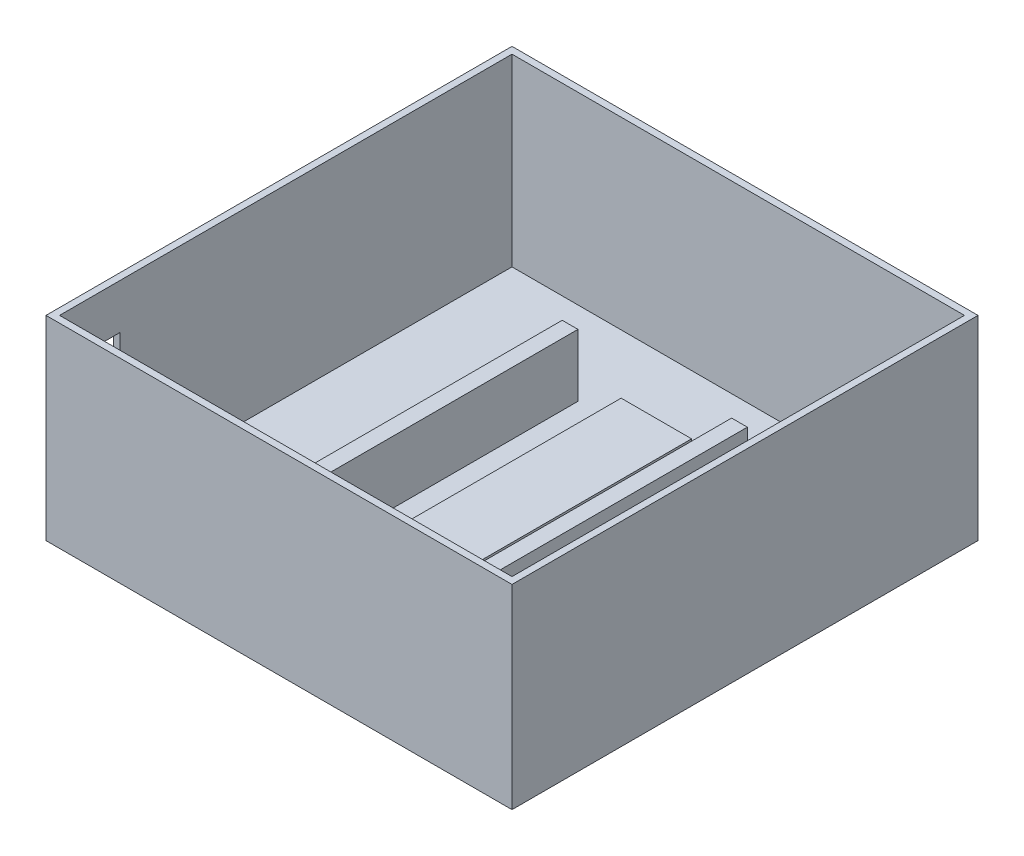
ISO-10303-21;
HEADER;
FILE_DESCRIPTION(('STEP AP214'),'2;1');
FILE_NAME('part.step','',(''),(''),'','','');
FILE_SCHEMA(('AUTOMOTIVE_DESIGN { 1 0 10303 214 1 1 1 1 }'));
ENDSEC;
DATA;
#1=APPLICATION_CONTEXT('core data for automotive mechanical design processes');
#2=APPLICATION_PROTOCOL_DEFINITION('international standard','automotive_design',2000,#1);
#3=PRODUCT_CONTEXT('',#1,'mechanical');
#4=PRODUCT('Part','Part','',(#3));
#5=PRODUCT_RELATED_PRODUCT_CATEGORY('part','',(#4));
#6=PRODUCT_DEFINITION_FORMATION('','',#4);
#7=PRODUCT_DEFINITION_CONTEXT('part definition',#1,'design');
#8=PRODUCT_DEFINITION('design','',#6,#7);
#9=PRODUCT_DEFINITION_SHAPE('','',#8);
#10=(LENGTH_UNIT() NAMED_UNIT(*) SI_UNIT(.MILLI.,.METRE.));
#11=(NAMED_UNIT(*) PLANE_ANGLE_UNIT() SI_UNIT($,.RADIAN.));
#12=(NAMED_UNIT(*) SI_UNIT($,.STERADIAN.) SOLID_ANGLE_UNIT());
#13=UNCERTAINTY_MEASURE_WITH_UNIT(LENGTH_MEASURE(1.E-05),#10,'distance_accuracy_value','');
#14=(GEOMETRIC_REPRESENTATION_CONTEXT(3) GLOBAL_UNCERTAINTY_ASSIGNED_CONTEXT((#13)) GLOBAL_UNIT_ASSIGNED_CONTEXT((#10,
#11,#12)) REPRESENTATION_CONTEXT('',''));
#15=CARTESIAN_POINT('',(0.,0.,0.));
#16=DIRECTION('',(0.,0.,1.));
#17=DIRECTION('',(1.,0.,0.));
#18=AXIS2_PLACEMENT_3D('',#15,#16,#17);
#19=CARTESIAN_POINT('',(14.1780902362177,13.5,0.));
#20=DIRECTION('',(1.,0.,0.));
#21=DIRECTION('',(0.,0.,-1.));
#22=AXIS2_PLACEMENT_3D('',#19,#20,#21);
#23=PLANE('',#22);
#24=DIRECTION('',(0.,0.,1.));
#25=VECTOR('',#24,1.);
#26=CARTESIAN_POINT('',(14.1780902362177,1.99999999999999,0.));
#27=LINE('',#26,#25);
#28=CARTESIAN_POINT('',(14.1780902362175,1.99999999999999,-26.3514914841522));
#29=VERTEX_POINT('',#28);
#30=CARTESIAN_POINT('',(14.1780902362179,1.99999999999999,26.3514914841522));
#31=VERTEX_POINT('',#30);
#32=EDGE_CURVE('E106',#29,#31,#27,.T.);
#33=ORIENTED_EDGE('',*,*,#32,.T.);
#34=DIRECTION('',(0.,-1.,0.));
#35=VECTOR('',#34,1.);
#36=CARTESIAN_POINT('',(14.1780902362179,13.5,26.3514914841522));
#37=LINE('',#36,#35);
#38=CARTESIAN_POINT('',(14.1780902362179,13.5,26.3514914841522));
#39=VERTEX_POINT('',#38);
#40=EDGE_CURVE('E12',#39,#31,#37,.T.);
#41=ORIENTED_EDGE('',*,*,#40,.F.);
#42=DIRECTION('',(0.,0.,1.));
#43=VECTOR('',#42,1.);
#44=CARTESIAN_POINT('',(14.1780902362177,13.5,0.));
#45=LINE('',#44,#43);
#46=CARTESIAN_POINT('',(14.1780902362175,13.5,-26.3514914841522));
#47=VERTEX_POINT('',#46);
#48=EDGE_CURVE('E94',#47,#39,#45,.T.);
#49=ORIENTED_EDGE('',*,*,#48,.F.);
#50=DIRECTION('',(0.,-1.,0.));
#51=VECTOR('',#50,1.);
#52=CARTESIAN_POINT('',(14.1780902362175,13.5,-26.3514914841522));
#53=LINE('',#52,#51);
#54=EDGE_CURVE('E102',#47,#29,#53,.T.);
#55=ORIENTED_EDGE('',*,*,#54,.T.);
#56=EDGE_LOOP('',(#33,#41,#49,#55));
#57=FACE_BOUND('',#56,.T.);
#58=ADVANCED_FACE('F43',(#57),#23,.F.);
#59=CARTESIAN_POINT('',(2.01394456665728E-12,13.5,26.3514914841533));
#60=DIRECTION('',(0.,0.,-1.));
#61=DIRECTION('',(-1.,0.,0.));
#62=AXIS2_PLACEMENT_3D('',#59,#60,#61);
#63=PLANE('',#62);
#64=DIRECTION('',(1.,0.,0.));
#65=VECTOR('',#64,1.);
#66=CARTESIAN_POINT('',(2.01394456665728E-12,1.99999999999999,26.3514914841533));
#67=LINE('',#66,#65);
#68=CARTESIAN_POINT('',(17.0834365961209,1.99999999999999,26.351491484152));
#69=VERTEX_POINT('',#68);
#70=EDGE_CURVE('E98',#31,#69,#67,.T.);
#71=ORIENTED_EDGE('',*,*,#70,.T.);
#72=DIRECTION('',(0.,-1.,0.));
#73=VECTOR('',#72,1.);
#74=CARTESIAN_POINT('',(17.0834365961209,13.5,26.351491484152));
#75=LINE('',#74,#73);
#76=CARTESIAN_POINT('',(17.0834365961209,13.5,26.351491484152));
#77=VERTEX_POINT('',#76);
#78=EDGE_CURVE('E51',#77,#69,#75,.T.);
#79=ORIENTED_EDGE('',*,*,#78,.F.);
#80=DIRECTION('',(1.,0.,0.));
#81=VECTOR('',#80,1.);
#82=CARTESIAN_POINT('',(2.01394456665728E-12,13.5,26.3514914841533));
#83=LINE('',#82,#81);
#84=EDGE_CURVE('E89',#39,#77,#83,.T.);
#85=ORIENTED_EDGE('',*,*,#84,.F.);
#86=ORIENTED_EDGE('',*,*,#40,.T.);
#87=EDGE_LOOP('',(#71,#79,#85,#86));
#88=FACE_BOUND('',#87,.T.);
#89=ADVANCED_FACE('F97',(#88),#63,.F.);
#90=CARTESIAN_POINT('',(17.0834365961207,13.5,-1.19208208170543E-13));
#91=DIRECTION('',(-1.,0.,0.));
#92=DIRECTION('',(0.,0.,1.));
#93=AXIS2_PLACEMENT_3D('',#90,#91,#92);
#94=PLANE('',#93);
#95=DIRECTION('',(0.,0.,-1.));
#96=VECTOR('',#95,1.);
#97=CARTESIAN_POINT('',(17.0834365961207,1.99999999999999,-1.19208208170543E-13));
#98=LINE('',#97,#96);
#99=CARTESIAN_POINT('',(17.0834365961205,1.99999999999999,-26.3514914841522));
#100=VERTEX_POINT('',#99);
#101=EDGE_CURVE('E76',#69,#100,#98,.T.);
#102=ORIENTED_EDGE('',*,*,#101,.T.);
#103=DIRECTION('',(0.,-1.,0.));
#104=VECTOR('',#103,1.);
#105=CARTESIAN_POINT('',(17.0834365961205,13.5,-26.3514914841522));
#106=LINE('',#105,#104);
#107=CARTESIAN_POINT('',(17.0834365961205,13.5,-26.3514914841522));
#108=VERTEX_POINT('',#107);
#109=EDGE_CURVE('E99',#108,#100,#106,.T.);
#110=ORIENTED_EDGE('',*,*,#109,.F.);
#111=DIRECTION('',(0.,0.,-1.));
#112=VECTOR('',#111,1.);
#113=CARTESIAN_POINT('',(17.0834365961207,13.5,-1.19208208170543E-13));
#114=LINE('',#113,#112);
#115=EDGE_CURVE('E92',#77,#108,#114,.T.);
#116=ORIENTED_EDGE('',*,*,#115,.F.);
#117=ORIENTED_EDGE('',*,*,#78,.T.);
#118=EDGE_LOOP('',(#102,#110,#116,#117));
#119=FACE_BOUND('',#118,.T.);
#120=ADVANCED_FACE('F100',(#119),#94,.F.);
#121=CARTESIAN_POINT('',(0.,13.5,-26.3514914841522));
#122=DIRECTION('',(0.,0.,1.));
#123=DIRECTION('',(1.,0.,0.));
#124=AXIS2_PLACEMENT_3D('',#121,#122,#123);
#125=PLANE('',#124);
#126=DIRECTION('',(-1.,0.,0.));
#127=VECTOR('',#126,1.);
#128=CARTESIAN_POINT('',(0.,1.99999999999999,-26.3514914841522));
#129=LINE('',#128,#127);
#130=EDGE_CURVE('E82',#100,#29,#129,.T.);
#131=ORIENTED_EDGE('',*,*,#130,.T.);
#132=ORIENTED_EDGE('',*,*,#54,.F.);
#133=DIRECTION('',(-1.,0.,0.));
#134=VECTOR('',#133,1.);
#135=CARTESIAN_POINT('',(0.,13.5,-26.3514914841522));
#136=LINE('',#135,#134);
#137=EDGE_CURVE('E59',#108,#47,#136,.T.);
#138=ORIENTED_EDGE('',*,*,#137,.F.);
#139=ORIENTED_EDGE('',*,*,#109,.T.);
#140=EDGE_LOOP('',(#131,#132,#138,#139));
#141=FACE_BOUND('',#140,.T.);
#142=ADVANCED_FACE('F113',(#141),#125,.F.);
#143=CARTESIAN_POINT('',(0.,13.5,0.));
#144=DIRECTION('',(0.,1.,0.));
#145=DIRECTION('',(0.,0.,1.));
#146=AXIS2_PLACEMENT_3D('',#143,#144,#145);
#147=PLANE('',#146);
#148=ORIENTED_EDGE('',*,*,#48,.T.);
#149=ORIENTED_EDGE('',*,*,#84,.T.);
#150=ORIENTED_EDGE('',*,*,#115,.T.);
#151=ORIENTED_EDGE('',*,*,#137,.T.);
#152=EDGE_LOOP('',(#148,#149,#150,#151));
#153=FACE_BOUND('',#152,.T.);
#154=ADVANCED_FACE('F90',(#153),#147,.T.);
#155=CARTESIAN_POINT('',(0.,1.99999999999999,0.));
#156=DIRECTION('',(0.,1.,0.));
#157=DIRECTION('',(0.,0.,1.));
#158=AXIS2_PLACEMENT_3D('',#155,#156,#157);
#159=PLANE('',#158);
#160=ORIENTED_EDGE('',*,*,#32,.F.);
#161=ORIENTED_EDGE('',*,*,#130,.F.);
#162=ORIENTED_EDGE('',*,*,#101,.F.);
#163=ORIENTED_EDGE('',*,*,#70,.F.);
#164=EDGE_LOOP('',(#160,#161,#162,#163));
#165=FACE_BOUND('',#164,.T.);
#166=ADVANCED_FACE('F116',(#165),#159,.F.);
#167=CLOSED_SHELL('',(#58,#89,#120,#142,#154,#166));
#168=MANIFOLD_SOLID_BREP('B2',#167);
#169=CARTESIAN_POINT('',(-17.0834365961207,13.5,0.));
#170=DIRECTION('',(1.,0.,0.));
#171=DIRECTION('',(0.,0.,-1.));
#172=AXIS2_PLACEMENT_3D('',#169,#170,#171);
#173=PLANE('',#172);
#174=DIRECTION('',(0.,0.,1.));
#175=VECTOR('',#174,1.);
#176=CARTESIAN_POINT('',(-17.0834365961207,1.99999999999999,0.));
#177=LINE('',#176,#175);
#178=CARTESIAN_POINT('',(-17.0834365961207,1.99999999999999,-26.3514914841522));
#179=VERTEX_POINT('',#178);
#180=CARTESIAN_POINT('',(-17.0834365961207,1.99999999999999,26.3514914841522));
#181=VERTEX_POINT('',#180);
#182=EDGE_CURVE('E238',#179,#181,#177,.T.);
#183=ORIENTED_EDGE('',*,*,#182,.T.);
#184=DIRECTION('',(0.,-1.,0.));
#185=VECTOR('',#184,1.);
#186=CARTESIAN_POINT('',(-17.0834365961207,13.5,26.3514914841522));
#187=LINE('',#186,#185);
#188=CARTESIAN_POINT('',(-17.0834365961207,13.5,26.3514914841522));
#189=VERTEX_POINT('',#188);
#190=EDGE_CURVE('E41',#189,#181,#187,.T.);
#191=ORIENTED_EDGE('',*,*,#190,.F.);
#192=DIRECTION('',(0.,0.,1.));
#193=VECTOR('',#192,1.);
#194=CARTESIAN_POINT('',(-17.0834365961207,13.5,0.));
#195=LINE('',#194,#193);
#196=CARTESIAN_POINT('',(-17.0834365961207,13.5,-26.3514914841522));
#197=VERTEX_POINT('',#196);
#198=EDGE_CURVE('E226',#197,#189,#195,.T.);
#199=ORIENTED_EDGE('',*,*,#198,.F.);
#200=DIRECTION('',(0.,-1.,0.));
#201=VECTOR('',#200,1.);
#202=CARTESIAN_POINT('',(-17.0834365961207,13.5,-26.3514914841522));
#203=LINE('',#202,#201);
#204=EDGE_CURVE('E234',#197,#179,#203,.T.);
#205=ORIENTED_EDGE('',*,*,#204,.T.);
#206=EDGE_LOOP('',(#183,#191,#199,#205));
#207=FACE_BOUND('',#206,.T.);
#208=ADVANCED_FACE('F175',(#207),#173,.F.);
#209=CARTESIAN_POINT('',(0.,13.5,26.3514914841522));
#210=DIRECTION('',(0.,0.,-1.));
#211=DIRECTION('',(-1.,0.,0.));
#212=AXIS2_PLACEMENT_3D('',#209,#210,#211);
#213=PLANE('',#212);
#214=DIRECTION('',(1.,0.,0.));
#215=VECTOR('',#214,1.);
#216=CARTESIAN_POINT('',(0.,1.99999999999999,26.3514914841522));
#217=LINE('',#216,#215);
#218=CARTESIAN_POINT('',(-14.1780902362177,1.99999999999999,26.3514914841522));
#219=VERTEX_POINT('',#218);
#220=EDGE_CURVE('E230',#181,#219,#217,.T.);
#221=ORIENTED_EDGE('',*,*,#220,.T.);
#222=DIRECTION('',(0.,-1.,0.));
#223=VECTOR('',#222,1.);
#224=CARTESIAN_POINT('',(-14.1780902362177,13.5,26.3514914841522));
#225=LINE('',#224,#223);
#226=CARTESIAN_POINT('',(-14.1780902362177,13.5,26.3514914841522));
#227=VERTEX_POINT('',#226);
#228=EDGE_CURVE('E183',#227,#219,#225,.T.);
#229=ORIENTED_EDGE('',*,*,#228,.F.);
#230=DIRECTION('',(1.,0.,0.));
#231=VECTOR('',#230,1.);
#232=CARTESIAN_POINT('',(0.,13.5,26.3514914841522));
#233=LINE('',#232,#231);
#234=EDGE_CURVE('E221',#189,#227,#233,.T.);
#235=ORIENTED_EDGE('',*,*,#234,.F.);
#236=ORIENTED_EDGE('',*,*,#190,.T.);
#237=EDGE_LOOP('',(#221,#229,#235,#236));
#238=FACE_BOUND('',#237,.T.);
#239=ADVANCED_FACE('F229',(#238),#213,.F.);
#240=CARTESIAN_POINT('',(-14.1780902362177,13.5,0.));
#241=DIRECTION('',(-1.,0.,0.));
#242=DIRECTION('',(0.,0.,1.));
#243=AXIS2_PLACEMENT_3D('',#240,#241,#242);
#244=PLANE('',#243);
#245=DIRECTION('',(0.,0.,-1.));
#246=VECTOR('',#245,1.);
#247=CARTESIAN_POINT('',(-14.1780902362177,1.99999999999999,0.));
#248=LINE('',#247,#246);
#249=CARTESIAN_POINT('',(-14.1780902362177,1.99999999999999,-26.3514914841522));
#250=VERTEX_POINT('',#249);
#251=EDGE_CURVE('E208',#219,#250,#248,.T.);
#252=ORIENTED_EDGE('',*,*,#251,.T.);
#253=DIRECTION('',(0.,-1.,0.));
#254=VECTOR('',#253,1.);
#255=CARTESIAN_POINT('',(-14.1780902362177,13.5,-26.3514914841522));
#256=LINE('',#255,#254);
#257=CARTESIAN_POINT('',(-14.1780902362177,13.5,-26.3514914841522));
#258=VERTEX_POINT('',#257);
#259=EDGE_CURVE('E231',#258,#250,#256,.T.);
#260=ORIENTED_EDGE('',*,*,#259,.F.);
#261=DIRECTION('',(0.,0.,-1.));
#262=VECTOR('',#261,1.);
#263=CARTESIAN_POINT('',(-14.1780902362177,13.5,0.));
#264=LINE('',#263,#262);
#265=EDGE_CURVE('E224',#227,#258,#264,.T.);
#266=ORIENTED_EDGE('',*,*,#265,.F.);
#267=ORIENTED_EDGE('',*,*,#228,.T.);
#268=EDGE_LOOP('',(#252,#260,#266,#267));
#269=FACE_BOUND('',#268,.T.);
#270=ADVANCED_FACE('F232',(#269),#244,.F.);
#271=CARTESIAN_POINT('',(0.,13.5,-26.3514914841522));
#272=DIRECTION('',(0.,0.,1.));
#273=DIRECTION('',(1.,0.,0.));
#274=AXIS2_PLACEMENT_3D('',#271,#272,#273);
#275=PLANE('',#274);
#276=DIRECTION('',(-1.,0.,0.));
#277=VECTOR('',#276,1.);
#278=CARTESIAN_POINT('',(0.,1.99999999999999,-26.3514914841522));
#279=LINE('',#278,#277);
#280=EDGE_CURVE('E214',#250,#179,#279,.T.);
#281=ORIENTED_EDGE('',*,*,#280,.T.);
#282=ORIENTED_EDGE('',*,*,#204,.F.);
#283=DIRECTION('',(-1.,0.,0.));
#284=VECTOR('',#283,1.);
#285=CARTESIAN_POINT('',(0.,13.5,-26.3514914841522));
#286=LINE('',#285,#284);
#287=EDGE_CURVE('E191',#258,#197,#286,.T.);
#288=ORIENTED_EDGE('',*,*,#287,.F.);
#289=ORIENTED_EDGE('',*,*,#259,.T.);
#290=EDGE_LOOP('',(#281,#282,#288,#289));
#291=FACE_BOUND('',#290,.T.);
#292=ADVANCED_FACE('F245',(#291),#275,.F.);
#293=CARTESIAN_POINT('',(0.,13.5,0.));
#294=DIRECTION('',(0.,1.,0.));
#295=DIRECTION('',(0.,0.,1.));
#296=AXIS2_PLACEMENT_3D('',#293,#294,#295);
#297=PLANE('',#296);
#298=ORIENTED_EDGE('',*,*,#198,.T.);
#299=ORIENTED_EDGE('',*,*,#234,.T.);
#300=ORIENTED_EDGE('',*,*,#265,.T.);
#301=ORIENTED_EDGE('',*,*,#287,.T.);
#302=EDGE_LOOP('',(#298,#299,#300,#301));
#303=FACE_BOUND('',#302,.T.);
#304=ADVANCED_FACE('F222',(#303),#297,.T.);
#305=CARTESIAN_POINT('',(0.,1.99999999999999,0.));
#306=DIRECTION('',(0.,1.,0.));
#307=DIRECTION('',(0.,0.,1.));
#308=AXIS2_PLACEMENT_3D('',#305,#306,#307);
#309=PLANE('',#308);
#310=ORIENTED_EDGE('',*,*,#182,.F.);
#311=ORIENTED_EDGE('',*,*,#280,.F.);
#312=ORIENTED_EDGE('',*,*,#251,.F.);
#313=ORIENTED_EDGE('',*,*,#220,.F.);
#314=EDGE_LOOP('',(#310,#311,#312,#313));
#315=FACE_BOUND('',#314,.T.);
#316=ADVANCED_FACE('F248',(#315),#309,.F.);
#317=CLOSED_SHELL('',(#208,#239,#270,#292,#304,#316));
#318=MANIFOLD_SOLID_BREP('B6',#317);
#319=CARTESIAN_POINT('',(0.,1.99999999999999,0.));
#320=DIRECTION('',(0.,1.,0.));
#321=DIRECTION('',(0.,0.,1.));
#322=AXIS2_PLACEMENT_3D('',#319,#320,#321);
#323=PLANE('',#322);
#324=DIRECTION('',(0.,0.,-1.));
#325=VECTOR('',#324,1.);
#326=CARTESIAN_POINT('',(41.75,1.99999999999999,-41.75));
#327=LINE('',#326,#325);
#328=CARTESIAN_POINT('',(41.75,1.99999999999999,41.75));
#329=VERTEX_POINT('',#328);
#330=CARTESIAN_POINT('',(41.75,1.99999999999999,-41.75));
#331=VERTEX_POINT('',#330);
#332=EDGE_CURVE('E469',#329,#331,#327,.T.);
#333=ORIENTED_EDGE('',*,*,#332,.T.);
#334=DIRECTION('',(-1.,0.,0.));
#335=VECTOR('',#334,1.);
#336=CARTESIAN_POINT('',(-41.75,1.99999999999999,-41.75));
#337=LINE('',#336,#335);
#338=CARTESIAN_POINT('',(-41.75,1.99999999999999,-41.75));
#339=VERTEX_POINT('',#338);
#340=EDGE_CURVE('E472',#331,#339,#337,.T.);
#341=ORIENTED_EDGE('',*,*,#340,.T.);
#342=DIRECTION('',(0.,0.,1.));
#343=VECTOR('',#342,1.);
#344=CARTESIAN_POINT('',(-41.75,1.99999999999999,-41.75));
#345=LINE('',#344,#343);
#346=CARTESIAN_POINT('',(-41.75,1.99999999999999,41.75));
#347=VERTEX_POINT('',#346);
#348=EDGE_CURVE('E476',#339,#347,#345,.T.);
#349=ORIENTED_EDGE('',*,*,#348,.T.);
#350=DIRECTION('',(1.,0.,0.));
#351=VECTOR('',#350,1.);
#352=CARTESIAN_POINT('',(-41.75,1.99999999999999,41.75));
#353=LINE('',#352,#351);
#354=EDGE_CURVE('E479',#347,#329,#353,.T.);
#355=ORIENTED_EDGE('',*,*,#354,.T.);
#356=EDGE_LOOP('',(#333,#341,#349,#355));
#357=FACE_BOUND('',#356,.T.);
#358=DIRECTION('',(-1.,0.,0.));
#359=VECTOR('',#358,1.);
#360=CARTESIAN_POINT('',(-6.5,1.99999999999999,-26.6420261201407));
#361=LINE('',#360,#359);
#362=CARTESIAN_POINT('',(6.5,1.99999999999999,-26.6420261201407));
#363=VERTEX_POINT('',#362);
#364=CARTESIAN_POINT('',(-6.5,1.99999999999999,-26.6420261201407));
#365=VERTEX_POINT('',#364);
#366=EDGE_CURVE('E453',#363,#365,#361,.T.);
#367=ORIENTED_EDGE('',*,*,#366,.F.);
#368=DIRECTION('',(0.,0.,-1.));
#369=VECTOR('',#368,1.);
#370=CARTESIAN_POINT('',(6.5,1.99999999999999,-26.6420261201407));
#371=LINE('',#370,#369);
#372=CARTESIAN_POINT('',(6.5,1.99999999999999,26.6420261201407));
#373=VERTEX_POINT('',#372);
#374=EDGE_CURVE('E437',#373,#363,#371,.T.);
#375=ORIENTED_EDGE('',*,*,#374,.F.);
#376=DIRECTION('',(1.,0.,0.));
#377=VECTOR('',#376,1.);
#378=CARTESIAN_POINT('',(-6.5,1.99999999999999,26.6420261201407));
#379=LINE('',#378,#377);
#380=CARTESIAN_POINT('',(-6.5,1.99999999999999,26.6420261201407));
#381=VERTEX_POINT('',#380);
#382=EDGE_CURVE('E444',#381,#373,#379,.T.);
#383=ORIENTED_EDGE('',*,*,#382,.F.);
#384=DIRECTION('',(0.,0.,1.));
#385=VECTOR('',#384,1.);
#386=CARTESIAN_POINT('',(-6.5,1.99999999999999,-26.6420261201407));
#387=LINE('',#386,#385);
#388=EDGE_CURVE('E455',#365,#381,#387,.T.);
#389=ORIENTED_EDGE('',*,*,#388,.F.);
#390=EDGE_LOOP('',(#367,#375,#383,#389));
#391=FACE_BOUND('',#390,.T.);
#392=ADVANCED_FACE('F298',(#357,#391),#323,.T.);
#393=CARTESIAN_POINT('',(43.,36.,-43.));
#394=DIRECTION('',(-1.,0.,0.));
#395=DIRECTION('',(0.,0.,1.));
#396=AXIS2_PLACEMENT_3D('',#393,#394,#395);
#397=PLANE('',#396);
#398=DIRECTION('',(0.,0.,-1.));
#399=VECTOR('',#398,1.);
#400=CARTESIAN_POINT('',(43.,0.,-43.));
#401=LINE('',#400,#399);
#402=CARTESIAN_POINT('',(43.,0.,43.));
#403=VERTEX_POINT('',#402);
#404=CARTESIAN_POINT('',(43.,0.,-43.));
#405=VERTEX_POINT('',#404);
#406=EDGE_CURVE('E494',#403,#405,#401,.T.);
#407=ORIENTED_EDGE('',*,*,#406,.T.);
#408=DIRECTION('',(0.,-1.,0.));
#409=VECTOR('',#408,1.);
#410=CARTESIAN_POINT('',(43.,36.,-43.));
#411=LINE('',#410,#409);
#412=CARTESIAN_POINT('',(43.,36.,-43.));
#413=VERTEX_POINT('',#412);
#414=EDGE_CURVE('E527',#413,#405,#411,.T.);
#415=ORIENTED_EDGE('',*,*,#414,.F.);
#416=DIRECTION('',(0.,0.,-1.));
#417=VECTOR('',#416,1.);
#418=CARTESIAN_POINT('',(43.,36.,-43.));
#419=LINE('',#418,#417);
#420=CARTESIAN_POINT('',(43.,36.,43.));
#421=VERTEX_POINT('',#420);
#422=EDGE_CURVE('E501',#421,#413,#419,.T.);
#423=ORIENTED_EDGE('',*,*,#422,.F.);
#424=DIRECTION('',(0.,-1.,0.));
#425=VECTOR('',#424,1.);
#426=CARTESIAN_POINT('',(43.,36.,43.));
#427=LINE('',#426,#425);
#428=EDGE_CURVE('E511',#421,#403,#427,.T.);
#429=ORIENTED_EDGE('',*,*,#428,.T.);
#430=EDGE_LOOP('',(#407,#415,#423,#429));
#431=FACE_BOUND('',#430,.T.);
#432=ADVANCED_FACE('F300',(#431),#397,.F.);
#433=CARTESIAN_POINT('',(-43.,36.,-43.));
#434=DIRECTION('',(0.,0.,1.));
#435=DIRECTION('',(1.,0.,0.));
#436=AXIS2_PLACEMENT_3D('',#433,#434,#435);
#437=PLANE('',#436);
#438=DIRECTION('',(-1.,0.,0.));
#439=VECTOR('',#438,1.);
#440=CARTESIAN_POINT('',(-43.,0.,-43.));
#441=LINE('',#440,#439);
#442=CARTESIAN_POINT('',(-43.,0.,-43.));
#443=VERTEX_POINT('',#442);
#444=EDGE_CURVE('E514',#405,#443,#441,.T.);
#445=ORIENTED_EDGE('',*,*,#444,.T.);
#446=DIRECTION('',(0.,-1.,0.));
#447=VECTOR('',#446,1.);
#448=CARTESIAN_POINT('',(-43.,36.,-43.));
#449=LINE('',#448,#447);
#450=CARTESIAN_POINT('',(-43.,36.,-43.));
#451=VERTEX_POINT('',#450);
#452=EDGE_CURVE('E524',#451,#443,#449,.T.);
#453=ORIENTED_EDGE('',*,*,#452,.F.);
#454=DIRECTION('',(-1.,0.,0.));
#455=VECTOR('',#454,1.);
#456=CARTESIAN_POINT('',(-43.,36.,-43.));
#457=LINE('',#456,#455);
#458=EDGE_CURVE('E504',#413,#451,#457,.T.);
#459=ORIENTED_EDGE('',*,*,#458,.F.);
#460=ORIENTED_EDGE('',*,*,#414,.T.);
#461=EDGE_LOOP('',(#445,#453,#459,#460));
#462=FACE_BOUND('',#461,.T.);
#463=ADVANCED_FACE('F558',(#462),#437,.F.);
#464=CARTESIAN_POINT('',(-43.,36.,-43.));
#465=DIRECTION('',(1.,0.,0.));
#466=DIRECTION('',(0.,0.,-1.));
#467=AXIS2_PLACEMENT_3D('',#464,#465,#466);
#468=PLANE('',#467);
#469=DIRECTION('',(0.,0.,-1.));
#470=VECTOR('',#469,1.);
#471=CARTESIAN_POINT('',(-43.,27.6863446400939,30.5697935394482));
#472=LINE('',#471,#470);
#473=CARTESIAN_POINT('',(-43.,27.6863446400939,38.5697935394482));
#474=VERTEX_POINT('',#473);
#475=CARTESIAN_POINT('',(-43.,27.6863446400939,30.5697935394482));
#476=VERTEX_POINT('',#475);
#477=EDGE_CURVE('E423',#474,#476,#472,.T.);
#478=ORIENTED_EDGE('',*,*,#477,.F.);
#479=DIRECTION('',(0.,1.,0.));
#480=VECTOR('',#479,1.);
#481=CARTESIAN_POINT('',(-43.,27.6863446400939,38.5697935394482));
#482=LINE('',#481,#480);
#483=CARTESIAN_POINT('',(-43.,17.1863446400939,38.5697935394482));
#484=VERTEX_POINT('',#483);
#485=EDGE_CURVE('E313',#484,#474,#482,.T.);
#486=ORIENTED_EDGE('',*,*,#485,.F.);
#487=DIRECTION('',(0.,0.,1.));
#488=VECTOR('',#487,1.);
#489=CARTESIAN_POINT('',(-43.,17.1863446400939,30.5697935394482));
#490=LINE('',#489,#488);
#491=CARTESIAN_POINT('',(-43.,17.1863446400939,30.5697935394482));
#492=VERTEX_POINT('',#491);
#493=EDGE_CURVE('E430',#492,#484,#490,.T.);
#494=ORIENTED_EDGE('',*,*,#493,.F.);
#495=DIRECTION('',(0.,-1.,0.));
#496=VECTOR('',#495,1.);
#497=CARTESIAN_POINT('',(-43.,27.6863446400939,30.5697935394482));
#498=LINE('',#497,#496);
#499=EDGE_CURVE('E414',#476,#492,#498,.T.);
#500=ORIENTED_EDGE('',*,*,#499,.F.);
#501=EDGE_LOOP('',(#478,#486,#494,#500));
#502=FACE_BOUND('',#501,.T.);
#503=DIRECTION('',(0.,0.,1.));
#504=VECTOR('',#503,1.);
#505=CARTESIAN_POINT('',(-43.,0.,-43.));
#506=LINE('',#505,#504);
#507=CARTESIAN_POINT('',(-43.,0.,43.));
#508=VERTEX_POINT('',#507);
#509=EDGE_CURVE('E516',#443,#508,#506,.T.);
#510=ORIENTED_EDGE('',*,*,#509,.T.);
#511=DIRECTION('',(0.,-1.,0.));
#512=VECTOR('',#511,1.);
#513=CARTESIAN_POINT('',(-43.,36.,43.));
#514=LINE('',#513,#512);
#515=CARTESIAN_POINT('',(-43.,36.,43.));
#516=VERTEX_POINT('',#515);
#517=EDGE_CURVE('E521',#516,#508,#514,.T.);
#518=ORIENTED_EDGE('',*,*,#517,.F.);
#519=DIRECTION('',(0.,0.,1.));
#520=VECTOR('',#519,1.);
#521=CARTESIAN_POINT('',(-43.,36.,-43.));
#522=LINE('',#521,#520);
#523=EDGE_CURVE('E507',#451,#516,#522,.T.);
#524=ORIENTED_EDGE('',*,*,#523,.F.);
#525=ORIENTED_EDGE('',*,*,#452,.T.);
#526=EDGE_LOOP('',(#510,#518,#524,#525));
#527=FACE_BOUND('',#526,.T.);
#528=ADVANCED_FACE('F427',(#502,#527),#468,.F.);
#529=CARTESIAN_POINT('',(-43.,36.,43.));
#530=DIRECTION('',(0.,0.,-1.));
#531=DIRECTION('',(-1.,0.,0.));
#532=AXIS2_PLACEMENT_3D('',#529,#530,#531);
#533=PLANE('',#532);
#534=DIRECTION('',(1.,0.,0.));
#535=VECTOR('',#534,1.);
#536=CARTESIAN_POINT('',(-43.,0.,43.));
#537=LINE('',#536,#535);
#538=EDGE_CURVE('E505',#508,#403,#537,.T.);
#539=ORIENTED_EDGE('',*,*,#538,.T.);
#540=ORIENTED_EDGE('',*,*,#428,.F.);
#541=DIRECTION('',(1.,0.,0.));
#542=VECTOR('',#541,1.);
#543=CARTESIAN_POINT('',(-43.,36.,43.));
#544=LINE('',#543,#542);
#545=EDGE_CURVE('E509',#516,#421,#544,.T.);
#546=ORIENTED_EDGE('',*,*,#545,.F.);
#547=ORIENTED_EDGE('',*,*,#517,.T.);
#548=EDGE_LOOP('',(#539,#540,#546,#547));
#549=FACE_BOUND('',#548,.T.);
#550=ADVANCED_FACE('F583',(#549),#533,.F.);
#551=CARTESIAN_POINT('',(0.,36.,0.));
#552=DIRECTION('',(0.,1.,0.));
#553=DIRECTION('',(0.,0.,1.));
#554=AXIS2_PLACEMENT_3D('',#551,#552,#553);
#555=PLANE('',#554);
#556=DIRECTION('',(0.,0.,-1.));
#557=VECTOR('',#556,1.);
#558=CARTESIAN_POINT('',(41.75,36.,-41.75));
#559=LINE('',#558,#557);
#560=CARTESIAN_POINT('',(41.75,36.,41.75));
#561=VERTEX_POINT('',#560);
#562=CARTESIAN_POINT('',(41.75,36.,-41.75));
#563=VERTEX_POINT('',#562);
#564=EDGE_CURVE('E468',#561,#563,#559,.T.);
#565=ORIENTED_EDGE('',*,*,#564,.F.);
#566=DIRECTION('',(1.,0.,0.));
#567=VECTOR('',#566,1.);
#568=CARTESIAN_POINT('',(-41.75,36.,41.75));
#569=LINE('',#568,#567);
#570=CARTESIAN_POINT('',(-41.75,36.,41.75));
#571=VERTEX_POINT('',#570);
#572=EDGE_CURVE('E473',#571,#561,#569,.T.);
#573=ORIENTED_EDGE('',*,*,#572,.F.);
#574=DIRECTION('',(0.,0.,1.));
#575=VECTOR('',#574,1.);
#576=CARTESIAN_POINT('',(-41.75,36.,-41.75));
#577=LINE('',#576,#575);
#578=CARTESIAN_POINT('',(-41.75,36.,-41.75));
#579=VERTEX_POINT('',#578);
#580=EDGE_CURVE('E487',#579,#571,#577,.T.);
#581=ORIENTED_EDGE('',*,*,#580,.F.);
#582=DIRECTION('',(-1.,0.,0.));
#583=VECTOR('',#582,1.);
#584=CARTESIAN_POINT('',(-41.75,36.,-41.75));
#585=LINE('',#584,#583);
#586=EDGE_CURVE('E484',#563,#579,#585,.T.);
#587=ORIENTED_EDGE('',*,*,#586,.F.);
#588=EDGE_LOOP('',(#565,#573,#581,#587));
#589=FACE_BOUND('',#588,.T.);
#590=ORIENTED_EDGE('',*,*,#422,.T.);
#591=ORIENTED_EDGE('',*,*,#458,.T.);
#592=ORIENTED_EDGE('',*,*,#523,.T.);
#593=ORIENTED_EDGE('',*,*,#545,.T.);
#594=EDGE_LOOP('',(#590,#591,#592,#593));
#595=FACE_BOUND('',#594,.T.);
#596=ADVANCED_FACE('F580',(#589,#595),#555,.T.);
#597=CARTESIAN_POINT('',(0.,0.,0.));
#598=DIRECTION('',(0.,1.,0.));
#599=DIRECTION('',(0.,0.,1.));
#600=AXIS2_PLACEMENT_3D('',#597,#598,#599);
#601=PLANE('',#600);
#602=ORIENTED_EDGE('',*,*,#406,.F.);
#603=ORIENTED_EDGE('',*,*,#538,.F.);
#604=ORIENTED_EDGE('',*,*,#509,.F.);
#605=ORIENTED_EDGE('',*,*,#444,.F.);
#606=EDGE_LOOP('',(#602,#603,#604,#605));
#607=FACE_BOUND('',#606,.T.);
#608=ADVANCED_FACE('F578',(#607),#601,.F.);
#609=CARTESIAN_POINT('',(41.75,1.99999999999999,-41.75));
#610=DIRECTION('',(1.,0.,0.));
#611=DIRECTION('',(0.,0.,-1.));
#612=AXIS2_PLACEMENT_3D('',#609,#610,#611);
#613=PLANE('',#612);
#614=ORIENTED_EDGE('',*,*,#564,.T.);
#615=DIRECTION('',(0.,1.,0.));
#616=VECTOR('',#615,1.);
#617=CARTESIAN_POINT('',(41.75,1.99999999999999,-41.75));
#618=LINE('',#617,#616);
#619=EDGE_CURVE('E482',#331,#563,#618,.T.);
#620=ORIENTED_EDGE('',*,*,#619,.F.);
#621=ORIENTED_EDGE('',*,*,#332,.F.);
#622=DIRECTION('',(0.,1.,0.));
#623=VECTOR('',#622,1.);
#624=CARTESIAN_POINT('',(41.75,1.99999999999999,41.75));
#625=LINE('',#624,#623);
#626=EDGE_CURVE('E492',#329,#561,#625,.T.);
#627=ORIENTED_EDGE('',*,*,#626,.T.);
#628=EDGE_LOOP('',(#614,#620,#621,#627));
#629=FACE_BOUND('',#628,.T.);
#630=ADVANCED_FACE('F568',(#629),#613,.F.);
#631=CARTESIAN_POINT('',(-41.75,1.99999999999999,41.75));
#632=DIRECTION('',(0.,0.,1.));
#633=DIRECTION('',(1.,0.,0.));
#634=AXIS2_PLACEMENT_3D('',#631,#632,#633);
#635=PLANE('',#634);
#636=ORIENTED_EDGE('',*,*,#572,.T.);
#637=ORIENTED_EDGE('',*,*,#626,.F.);
#638=ORIENTED_EDGE('',*,*,#354,.F.);
#639=DIRECTION('',(0.,1.,0.));
#640=VECTOR('',#639,1.);
#641=CARTESIAN_POINT('',(-41.75,1.99999999999999,41.75));
#642=LINE('',#641,#640);
#643=EDGE_CURVE('E495',#347,#571,#642,.T.);
#644=ORIENTED_EDGE('',*,*,#643,.T.);
#645=EDGE_LOOP('',(#636,#637,#638,#644));
#646=FACE_BOUND('',#645,.T.);
#647=ADVANCED_FACE('F565',(#646),#635,.F.);
#648=CARTESIAN_POINT('',(-41.75,1.99999999999999,-41.75));
#649=DIRECTION('',(-1.,0.,0.));
#650=DIRECTION('',(0.,0.,1.));
#651=AXIS2_PLACEMENT_3D('',#648,#649,#650);
#652=PLANE('',#651);
#653=DIRECTION('',(0.,0.,1.));
#654=VECTOR('',#653,1.);
#655=CARTESIAN_POINT('',(-41.75,17.1863446400939,-41.75));
#656=LINE('',#655,#654);
#657=CARTESIAN_POINT('',(-41.75,17.1863446400939,30.5697935394482));
#658=VERTEX_POINT('',#657);
#659=CARTESIAN_POINT('',(-41.75,17.1863446400939,38.5697935394482));
#660=VERTEX_POINT('',#659);
#661=EDGE_CURVE('E306',#658,#660,#656,.T.);
#662=ORIENTED_EDGE('',*,*,#661,.T.);
#663=DIRECTION('',(0.,1.,0.));
#664=VECTOR('',#663,1.);
#665=CARTESIAN_POINT('',(-41.75,1.99999999999999,38.5697935394482));
#666=LINE('',#665,#664);
#667=CARTESIAN_POINT('',(-41.75,27.6863446400939,38.5697935394482));
#668=VERTEX_POINT('',#667);
#669=EDGE_CURVE('E173',#660,#668,#666,.T.);
#670=ORIENTED_EDGE('',*,*,#669,.T.);
#671=DIRECTION('',(0.,0.,-1.));
#672=VECTOR('',#671,1.);
#673=CARTESIAN_POINT('',(-41.75,27.6863446400939,-41.75));
#674=LINE('',#673,#672);
#675=CARTESIAN_POINT('',(-41.75,27.6863446400939,30.5697935394482));
#676=VERTEX_POINT('',#675);
#677=EDGE_CURVE('E530',#668,#676,#674,.T.);
#678=ORIENTED_EDGE('',*,*,#677,.T.);
#679=DIRECTION('',(0.,-1.,0.));
#680=VECTOR('',#679,1.);
#681=CARTESIAN_POINT('',(-41.75,1.99999999999995,30.5697935394482));
#682=LINE('',#681,#680);
#683=EDGE_CURVE('E417',#676,#658,#682,.T.);
#684=ORIENTED_EDGE('',*,*,#683,.T.);
#685=EDGE_LOOP('',(#662,#670,#678,#684));
#686=FACE_BOUND('',#685,.T.);
#687=ORIENTED_EDGE('',*,*,#580,.T.);
#688=ORIENTED_EDGE('',*,*,#643,.F.);
#689=ORIENTED_EDGE('',*,*,#348,.F.);
#690=DIRECTION('',(0.,1.,0.));
#691=VECTOR('',#690,1.);
#692=CARTESIAN_POINT('',(-41.75,1.99999999999999,-41.75));
#693=LINE('',#692,#691);
#694=EDGE_CURVE('E497',#339,#579,#693,.T.);
#695=ORIENTED_EDGE('',*,*,#694,.T.);
#696=EDGE_LOOP('',(#687,#688,#689,#695));
#697=FACE_BOUND('',#696,.T.);
#698=ADVANCED_FACE('F534',(#686,#697),#652,.F.);
#699=CARTESIAN_POINT('',(-41.75,1.99999999999999,-41.75));
#700=DIRECTION('',(0.,0.,-1.));
#701=DIRECTION('',(-1.,0.,0.));
#702=AXIS2_PLACEMENT_3D('',#699,#700,#701);
#703=PLANE('',#702);
#704=ORIENTED_EDGE('',*,*,#586,.T.);
#705=ORIENTED_EDGE('',*,*,#694,.F.);
#706=ORIENTED_EDGE('',*,*,#340,.F.);
#707=ORIENTED_EDGE('',*,*,#619,.T.);
#708=EDGE_LOOP('',(#704,#705,#706,#707));
#709=FACE_BOUND('',#708,.T.);
#710=ADVANCED_FACE('F572',(#709),#703,.F.);
#711=CARTESIAN_POINT('',(6.5,6.2,-26.6420261201407));
#712=DIRECTION('',(-1.,0.,0.));
#713=DIRECTION('',(0.,0.,1.));
#714=AXIS2_PLACEMENT_3D('',#711,#712,#713);
#715=PLANE('',#714);
#716=ORIENTED_EDGE('',*,*,#374,.T.);
#717=DIRECTION('',(0.,-1.,0.));
#718=VECTOR('',#717,1.);
#719=CARTESIAN_POINT('',(6.5,6.2,-26.6420261201407));
#720=LINE('',#719,#718);
#721=CARTESIAN_POINT('',(6.5,6.2,-26.6420261201407));
#722=VERTEX_POINT('',#721);
#723=EDGE_CURVE('E466',#722,#363,#720,.T.);
#724=ORIENTED_EDGE('',*,*,#723,.F.);
#725=DIRECTION('',(0.,0.,-1.));
#726=VECTOR('',#725,1.);
#727=CARTESIAN_POINT('',(6.5,6.2,-26.6420261201407));
#728=LINE('',#727,#726);
#729=CARTESIAN_POINT('',(6.5,6.2,26.6420261201407));
#730=VERTEX_POINT('',#729);
#731=EDGE_CURVE('E440',#730,#722,#728,.T.);
#732=ORIENTED_EDGE('',*,*,#731,.F.);
#733=DIRECTION('',(0.,-1.,0.));
#734=VECTOR('',#733,1.);
#735=CARTESIAN_POINT('',(6.5,6.2,26.6420261201407));
#736=LINE('',#735,#734);
#737=EDGE_CURVE('E450',#730,#373,#736,.T.);
#738=ORIENTED_EDGE('',*,*,#737,.T.);
#739=EDGE_LOOP('',(#716,#724,#732,#738));
#740=FACE_BOUND('',#739,.T.);
#741=ADVANCED_FACE('F563',(#740),#715,.F.);
#742=CARTESIAN_POINT('',(-6.5,6.2,-26.6420261201407));
#743=DIRECTION('',(0.,0.,1.));
#744=DIRECTION('',(1.,0.,0.));
#745=AXIS2_PLACEMENT_3D('',#742,#743,#744);
#746=PLANE('',#745);
#747=ORIENTED_EDGE('',*,*,#366,.T.);
#748=DIRECTION('',(0.,-1.,0.));
#749=VECTOR('',#748,1.);
#750=CARTESIAN_POINT('',(-6.5,6.2,-26.6420261201407));
#751=LINE('',#750,#749);
#752=CARTESIAN_POINT('',(-6.5,6.2,-26.6420261201407));
#753=VERTEX_POINT('',#752);
#754=EDGE_CURVE('E463',#753,#365,#751,.T.);
#755=ORIENTED_EDGE('',*,*,#754,.F.);
#756=DIRECTION('',(-1.,0.,0.));
#757=VECTOR('',#756,1.);
#758=CARTESIAN_POINT('',(-6.5,6.2,-26.6420261201407));
#759=LINE('',#758,#757);
#760=EDGE_CURVE('E443',#722,#753,#759,.T.);
#761=ORIENTED_EDGE('',*,*,#760,.F.);
#762=ORIENTED_EDGE('',*,*,#723,.T.);
#763=EDGE_LOOP('',(#747,#755,#761,#762));
#764=FACE_BOUND('',#763,.T.);
#765=ADVANCED_FACE('F648',(#764),#746,.F.);
#766=CARTESIAN_POINT('',(-6.5,6.2,-26.6420261201407));
#767=DIRECTION('',(1.,0.,0.));
#768=DIRECTION('',(0.,0.,-1.));
#769=AXIS2_PLACEMENT_3D('',#766,#767,#768);
#770=PLANE('',#769);
#771=ORIENTED_EDGE('',*,*,#388,.T.);
#772=DIRECTION('',(0.,-1.,0.));
#773=VECTOR('',#772,1.);
#774=CARTESIAN_POINT('',(-6.5,6.2,26.6420261201407));
#775=LINE('',#774,#773);
#776=CARTESIAN_POINT('',(-6.5,6.2,26.6420261201407));
#777=VERTEX_POINT('',#776);
#778=EDGE_CURVE('E461',#777,#381,#775,.T.);
#779=ORIENTED_EDGE('',*,*,#778,.F.);
#780=DIRECTION('',(0.,0.,1.));
#781=VECTOR('',#780,1.);
#782=CARTESIAN_POINT('',(-6.5,6.2,-26.6420261201407));
#783=LINE('',#782,#781);
#784=EDGE_CURVE('E446',#753,#777,#783,.T.);
#785=ORIENTED_EDGE('',*,*,#784,.F.);
#786=ORIENTED_EDGE('',*,*,#754,.T.);
#787=EDGE_LOOP('',(#771,#779,#785,#786));
#788=FACE_BOUND('',#787,.T.);
#789=ADVANCED_FACE('F655',(#788),#770,.F.);
#790=CARTESIAN_POINT('',(-6.5,6.2,26.6420261201407));
#791=DIRECTION('',(0.,0.,-1.));
#792=DIRECTION('',(-1.,0.,0.));
#793=AXIS2_PLACEMENT_3D('',#790,#791,#792);
#794=PLANE('',#793);
#795=ORIENTED_EDGE('',*,*,#382,.T.);
#796=ORIENTED_EDGE('',*,*,#737,.F.);
#797=DIRECTION('',(1.,0.,0.));
#798=VECTOR('',#797,1.);
#799=CARTESIAN_POINT('',(-6.5,6.2,26.6420261201407));
#800=LINE('',#799,#798);
#801=EDGE_CURVE('E448',#777,#730,#800,.T.);
#802=ORIENTED_EDGE('',*,*,#801,.F.);
#803=ORIENTED_EDGE('',*,*,#778,.T.);
#804=EDGE_LOOP('',(#795,#796,#802,#803));
#805=FACE_BOUND('',#804,.T.);
#806=ADVANCED_FACE('F548',(#805),#794,.F.);
#807=CARTESIAN_POINT('',(0.,6.2,0.));
#808=DIRECTION('',(0.,1.,0.));
#809=DIRECTION('',(0.,0.,1.));
#810=AXIS2_PLACEMENT_3D('',#807,#808,#809);
#811=PLANE('',#810);
#812=ORIENTED_EDGE('',*,*,#731,.T.);
#813=ORIENTED_EDGE('',*,*,#760,.T.);
#814=ORIENTED_EDGE('',*,*,#784,.T.);
#815=ORIENTED_EDGE('',*,*,#801,.T.);
#816=EDGE_LOOP('',(#812,#813,#814,#815));
#817=FACE_BOUND('',#816,.T.);
#818=ADVANCED_FACE('F541',(#817),#811,.T.);
#819=CARTESIAN_POINT('',(-41.,27.6863446400939,38.5697935394482));
#820=DIRECTION('',(0.,0.,1.));
#821=DIRECTION('',(1.,0.,0.));
#822=AXIS2_PLACEMENT_3D('',#819,#820,#821);
#823=PLANE('',#822);
#824=DIRECTION('',(-1.,0.,0.));
#825=VECTOR('',#824,1.);
#826=CARTESIAN_POINT('',(-41.,17.1863446400939,38.5697935394482));
#827=LINE('',#826,#825);
#828=EDGE_CURVE('E435',#660,#484,#827,.T.);
#829=ORIENTED_EDGE('',*,*,#828,.T.);
#830=ORIENTED_EDGE('',*,*,#485,.T.);
#831=DIRECTION('',(-1.,0.,0.));
#832=VECTOR('',#831,1.);
#833=CARTESIAN_POINT('',(-41.,27.6863446400939,38.5697935394482));
#834=LINE('',#833,#832);
#835=EDGE_CURVE('E420',#668,#474,#834,.T.);
#836=ORIENTED_EDGE('',*,*,#835,.F.);
#837=ORIENTED_EDGE('',*,*,#669,.F.);
#838=EDGE_LOOP('',(#829,#830,#836,#837));
#839=FACE_BOUND('',#838,.T.);
#840=ADVANCED_FACE('F539',(#839),#823,.F.);
#841=CARTESIAN_POINT('',(-41.,17.1863446400939,30.5697935394482));
#842=DIRECTION('',(0.,-1.,0.));
#843=DIRECTION('',(0.,0.,-1.));
#844=AXIS2_PLACEMENT_3D('',#841,#842,#843);
#845=PLANE('',#844);
#846=DIRECTION('',(-1.,0.,0.));
#847=VECTOR('',#846,1.);
#848=CARTESIAN_POINT('',(-41.,17.1863446400939,30.5697935394482));
#849=LINE('',#848,#847);
#850=EDGE_CURVE('E419',#658,#492,#849,.T.);
#851=ORIENTED_EDGE('',*,*,#850,.T.);
#852=ORIENTED_EDGE('',*,*,#493,.T.);
#853=ORIENTED_EDGE('',*,*,#828,.F.);
#854=ORIENTED_EDGE('',*,*,#661,.F.);
#855=EDGE_LOOP('',(#851,#852,#853,#854));
#856=FACE_BOUND('',#855,.T.);
#857=ADVANCED_FACE('F538',(#856),#845,.F.);
#858=CARTESIAN_POINT('',(-41.,27.6863446400939,30.5697935394482));
#859=DIRECTION('',(0.,0.,-1.));
#860=DIRECTION('',(0.,1.,0.));
#861=AXIS2_PLACEMENT_3D('',#858,#859,#860);
#862=PLANE('',#861);
#863=DIRECTION('',(-1.,0.,0.));
#864=VECTOR('',#863,1.);
#865=CARTESIAN_POINT('',(-41.,27.6863446400939,30.5697935394482));
#866=LINE('',#865,#864);
#867=EDGE_CURVE('E321',#676,#476,#866,.T.);
#868=ORIENTED_EDGE('',*,*,#867,.T.);
#869=ORIENTED_EDGE('',*,*,#499,.T.);
#870=ORIENTED_EDGE('',*,*,#850,.F.);
#871=ORIENTED_EDGE('',*,*,#683,.F.);
#872=EDGE_LOOP('',(#868,#869,#870,#871));
#873=FACE_BOUND('',#872,.T.);
#874=ADVANCED_FACE('F411',(#873),#862,.F.);
#875=CARTESIAN_POINT('',(-41.,27.6863446400939,30.5697935394482));
#876=DIRECTION('',(0.,1.,0.));
#877=DIRECTION('',(0.,0.,1.));
#878=AXIS2_PLACEMENT_3D('',#875,#876,#877);
#879=PLANE('',#878);
#880=ORIENTED_EDGE('',*,*,#835,.T.);
#881=ORIENTED_EDGE('',*,*,#477,.T.);
#882=ORIENTED_EDGE('',*,*,#867,.F.);
#883=ORIENTED_EDGE('',*,*,#677,.F.);
#884=EDGE_LOOP('',(#880,#881,#882,#883));
#885=FACE_BOUND('',#884,.T.);
#886=ADVANCED_FACE('F424',(#885),#879,.F.);
#887=CLOSED_SHELL('',(#392,#432,#463,#528,#550,#596,#608,#630,#647,#698,#710,#741,#765,#789,
#806,#818,#840,#857,#874,#886));
#888=MANIFOLD_SOLID_BREP('B35',#887);
#889=ADVANCED_BREP_SHAPE_REPRESENTATION('',(#18,#168,#318,#888),#14);
#890=SHAPE_DEFINITION_REPRESENTATION(#9,#889);
ENDSEC;
END-ISO-10303-21;
